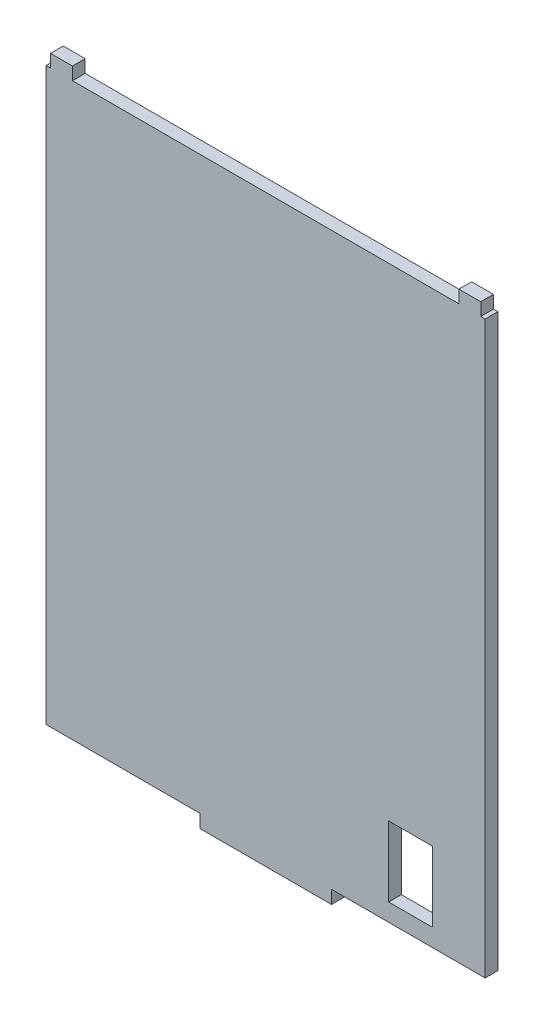
ISO-10303-21;
HEADER;
FILE_DESCRIPTION(('STEP AP214'),'2;1');
FILE_NAME('part.step','',(''),(''),'','','');
FILE_SCHEMA(('AUTOMOTIVE_DESIGN { 1 0 10303 214 1 1 1 1 }'));
ENDSEC;
DATA;
#1=APPLICATION_CONTEXT('core data for automotive mechanical design processes');
#2=APPLICATION_PROTOCOL_DEFINITION('international standard','automotive_design',2000,#1);
#3=PRODUCT_CONTEXT('',#1,'mechanical');
#4=PRODUCT('Part','Part','',(#3));
#5=PRODUCT_RELATED_PRODUCT_CATEGORY('part','',(#4));
#6=PRODUCT_DEFINITION_FORMATION('','',#4);
#7=PRODUCT_DEFINITION_CONTEXT('part definition',#1,'design');
#8=PRODUCT_DEFINITION('design','',#6,#7);
#9=PRODUCT_DEFINITION_SHAPE('','',#8);
#10=(LENGTH_UNIT() NAMED_UNIT(*) SI_UNIT(.MILLI.,.METRE.));
#11=(NAMED_UNIT(*) PLANE_ANGLE_UNIT() SI_UNIT($,.RADIAN.));
#12=(NAMED_UNIT(*) SI_UNIT($,.STERADIAN.) SOLID_ANGLE_UNIT());
#13=UNCERTAINTY_MEASURE_WITH_UNIT(LENGTH_MEASURE(1.E-05),#10,'distance_accuracy_value','');
#14=(GEOMETRIC_REPRESENTATION_CONTEXT(3) GLOBAL_UNCERTAINTY_ASSIGNED_CONTEXT((#13)) GLOBAL_UNIT_ASSIGNED_CONTEXT((#10,
#11,#12)) REPRESENTATION_CONTEXT('',''));
#15=CARTESIAN_POINT('',(0.,0.,0.));
#16=DIRECTION('',(0.,0.,1.));
#17=DIRECTION('',(1.,0.,0.));
#18=AXIS2_PLACEMENT_3D('',#15,#16,#17);
#19=CARTESIAN_POINT('',(35.,0.,2.9));
#20=DIRECTION('',(1.,0.,0.));
#21=DIRECTION('',(0.,0.,-1.));
#22=AXIS2_PLACEMENT_3D('',#19,#20,#21);
#23=PLANE('',#22);
#24=DIRECTION('',(0.,-1.,0.));
#25=VECTOR('',#24,1.);
#26=CARTESIAN_POINT('',(35.,0.,0.));
#27=LINE('',#26,#25);
#28=CARTESIAN_POINT('',(35.,0.,0.));
#29=VERTEX_POINT('',#28);
#30=CARTESIAN_POINT('',(35.,-3.,0.));
#31=VERTEX_POINT('',#30);
#32=EDGE_CURVE('E218',#29,#31,#27,.T.);
#33=ORIENTED_EDGE('',*,*,#32,.T.);
#34=DIRECTION('',(0.,0.,-1.));
#35=VECTOR('',#34,1.);
#36=CARTESIAN_POINT('',(35.,-3.,2.9));
#37=LINE('',#36,#35);
#38=CARTESIAN_POINT('',(35.,-3.,2.9));
#39=VERTEX_POINT('',#38);
#40=EDGE_CURVE('E11',#39,#31,#37,.T.);
#41=ORIENTED_EDGE('',*,*,#40,.F.);
#42=DIRECTION('',(0.,-1.,0.));
#43=VECTOR('',#42,1.);
#44=CARTESIAN_POINT('',(35.,0.,2.9));
#45=LINE('',#44,#43);
#46=CARTESIAN_POINT('',(35.,0.,2.9));
#47=VERTEX_POINT('',#46);
#48=EDGE_CURVE('E390',#47,#39,#45,.T.);
#49=ORIENTED_EDGE('',*,*,#48,.F.);
#50=DIRECTION('',(0.,0.,-1.));
#51=VECTOR('',#50,1.);
#52=CARTESIAN_POINT('',(35.,0.,2.9));
#53=LINE('',#52,#51);
#54=EDGE_CURVE('E257',#47,#29,#53,.T.);
#55=ORIENTED_EDGE('',*,*,#54,.T.);
#56=EDGE_LOOP('',(#33,#41,#49,#55));
#57=FACE_BOUND('',#56,.T.);
#58=ADVANCED_FACE('F35',(#57),#23,.F.);
#59=CARTESIAN_POINT('',(0.,-3.,2.9));
#60=DIRECTION('',(0.,1.,0.));
#61=DIRECTION('',(0.,0.,1.));
#62=AXIS2_PLACEMENT_3D('',#59,#60,#61);
#63=PLANE('',#62);
#64=DIRECTION('',(1.,0.,0.));
#65=VECTOR('',#64,1.);
#66=CARTESIAN_POINT('',(0.,-3.,0.));
#67=LINE('',#66,#65);
#68=CARTESIAN_POINT('',(65.,-3.,0.));
#69=VERTEX_POINT('',#68);
#70=EDGE_CURVE('E221',#31,#69,#67,.T.);
#71=ORIENTED_EDGE('',*,*,#70,.T.);
#72=DIRECTION('',(0.,0.,-1.));
#73=VECTOR('',#72,1.);
#74=CARTESIAN_POINT('',(65.,-3.,2.9));
#75=LINE('',#74,#73);
#76=CARTESIAN_POINT('',(65.,-3.,2.9));
#77=VERTEX_POINT('',#76);
#78=EDGE_CURVE('E45',#77,#69,#75,.T.);
#79=ORIENTED_EDGE('',*,*,#78,.F.);
#80=DIRECTION('',(1.,0.,0.));
#81=VECTOR('',#80,1.);
#82=CARTESIAN_POINT('',(0.,-3.,2.9));
#83=LINE('',#82,#81);
#84=EDGE_CURVE('E392',#39,#77,#83,.T.);
#85=ORIENTED_EDGE('',*,*,#84,.F.);
#86=ORIENTED_EDGE('',*,*,#40,.T.);
#87=EDGE_LOOP('',(#71,#79,#85,#86));
#88=FACE_BOUND('',#87,.T.);
#89=ADVANCED_FACE('F319',(#88),#63,.F.);
#90=CARTESIAN_POINT('',(65.,0.,2.9));
#91=DIRECTION('',(1.,0.,0.));
#92=DIRECTION('',(0.,0.,-1.));
#93=AXIS2_PLACEMENT_3D('',#90,#91,#92);
#94=PLANE('',#93);
#95=DIRECTION('',(0.,-1.,0.));
#96=VECTOR('',#95,1.);
#97=CARTESIAN_POINT('',(65.,0.,0.));
#98=LINE('',#97,#96);
#99=CARTESIAN_POINT('',(65.,0.,0.));
#100=VERTEX_POINT('',#99);
#101=EDGE_CURVE('E224',#100,#69,#98,.T.);
#102=ORIENTED_EDGE('',*,*,#101,.F.);
#103=DIRECTION('',(0.,0.,-1.));
#104=VECTOR('',#103,1.);
#105=CARTESIAN_POINT('',(65.,0.,2.9));
#106=LINE('',#105,#104);
#107=CARTESIAN_POINT('',(65.,0.,2.9));
#108=VERTEX_POINT('',#107);
#109=EDGE_CURVE('E284',#108,#100,#106,.T.);
#110=ORIENTED_EDGE('',*,*,#109,.F.);
#111=DIRECTION('',(0.,-1.,0.));
#112=VECTOR('',#111,1.);
#113=CARTESIAN_POINT('',(65.,0.,2.9));
#114=LINE('',#113,#112);
#115=EDGE_CURVE('E394',#108,#77,#114,.T.);
#116=ORIENTED_EDGE('',*,*,#115,.T.);
#117=ORIENTED_EDGE('',*,*,#78,.T.);
#118=EDGE_LOOP('',(#102,#110,#116,#117));
#119=FACE_BOUND('',#118,.T.);
#120=ADVANCED_FACE('F325',(#119),#94,.T.);
#121=CARTESIAN_POINT('',(0.,0.,2.9));
#122=DIRECTION('',(0.,1.,0.));
#123=DIRECTION('',(0.,0.,1.));
#124=AXIS2_PLACEMENT_3D('',#121,#122,#123);
#125=PLANE('',#124);
#126=DIRECTION('',(1.,0.,0.));
#127=VECTOR('',#126,1.);
#128=CARTESIAN_POINT('',(0.,0.,0.));
#129=LINE('',#128,#127);
#130=CARTESIAN_POINT('',(100.,0.,0.));
#131=VERTEX_POINT('',#130);
#132=EDGE_CURVE('E227',#100,#131,#129,.T.);
#133=ORIENTED_EDGE('',*,*,#132,.T.);
#134=DIRECTION('',(0.,0.,-1.));
#135=VECTOR('',#134,1.);
#136=CARTESIAN_POINT('',(100.,0.,2.9));
#137=LINE('',#136,#135);
#138=CARTESIAN_POINT('',(100.,0.,2.9));
#139=VERTEX_POINT('',#138);
#140=EDGE_CURVE('E281',#139,#131,#137,.T.);
#141=ORIENTED_EDGE('',*,*,#140,.F.);
#142=DIRECTION('',(1.,0.,0.));
#143=VECTOR('',#142,1.);
#144=CARTESIAN_POINT('',(0.,0.,2.9));
#145=LINE('',#144,#143);
#146=EDGE_CURVE('E397',#108,#139,#145,.T.);
#147=ORIENTED_EDGE('',*,*,#146,.F.);
#148=ORIENTED_EDGE('',*,*,#109,.T.);
#149=EDGE_LOOP('',(#133,#141,#147,#148));
#150=FACE_BOUND('',#149,.T.);
#151=ADVANCED_FACE('F331',(#150),#125,.F.);
#152=CARTESIAN_POINT('',(100.,0.,2.9));
#153=DIRECTION('',(-1.,0.,0.));
#154=DIRECTION('',(0.,0.,1.));
#155=AXIS2_PLACEMENT_3D('',#152,#153,#154);
#156=PLANE('',#155);
#157=DIRECTION('',(0.,1.,0.));
#158=VECTOR('',#157,1.);
#159=CARTESIAN_POINT('',(100.,0.,0.));
#160=LINE('',#159,#158);
#161=CARTESIAN_POINT('',(100.,130.,0.));
#162=VERTEX_POINT('',#161);
#163=EDGE_CURVE('E229',#131,#162,#160,.T.);
#164=ORIENTED_EDGE('',*,*,#163,.T.);
#165=DIRECTION('',(0.,0.,-1.));
#166=VECTOR('',#165,1.);
#167=CARTESIAN_POINT('',(100.,130.,2.9));
#168=LINE('',#167,#166);
#169=CARTESIAN_POINT('',(100.,130.,2.9));
#170=VERTEX_POINT('',#169);
#171=EDGE_CURVE('E278',#170,#162,#168,.T.);
#172=ORIENTED_EDGE('',*,*,#171,.F.);
#173=DIRECTION('',(0.,1.,0.));
#174=VECTOR('',#173,1.);
#175=CARTESIAN_POINT('',(100.,0.,2.9));
#176=LINE('',#175,#174);
#177=EDGE_CURVE('E399',#139,#170,#176,.T.);
#178=ORIENTED_EDGE('',*,*,#177,.F.);
#179=ORIENTED_EDGE('',*,*,#140,.T.);
#180=EDGE_LOOP('',(#164,#172,#178,#179));
#181=FACE_BOUND('',#180,.T.);
#182=ADVANCED_FACE('F335',(#181),#156,.F.);
#183=CARTESIAN_POINT('',(0.,130.,2.9));
#184=DIRECTION('',(0.,-1.,0.));
#185=DIRECTION('',(0.,0.,-1.));
#186=AXIS2_PLACEMENT_3D('',#183,#184,#185);
#187=PLANE('',#186);
#188=DIRECTION('',(-1.,0.,0.));
#189=VECTOR('',#188,1.);
#190=CARTESIAN_POINT('',(0.,130.,0.));
#191=LINE('',#190,#189);
#192=CARTESIAN_POINT('',(99.,130.,0.));
#193=VERTEX_POINT('',#192);
#194=EDGE_CURVE('E231',#162,#193,#191,.T.);
#195=ORIENTED_EDGE('',*,*,#194,.T.);
#196=DIRECTION('',(0.,0.,-1.));
#197=VECTOR('',#196,1.);
#198=CARTESIAN_POINT('',(99.,130.,2.9));
#199=LINE('',#198,#197);
#200=CARTESIAN_POINT('',(99.,130.,2.9));
#201=VERTEX_POINT('',#200);
#202=EDGE_CURVE('E275',#201,#193,#199,.T.);
#203=ORIENTED_EDGE('',*,*,#202,.F.);
#204=DIRECTION('',(-1.,0.,0.));
#205=VECTOR('',#204,1.);
#206=CARTESIAN_POINT('',(0.,130.,2.9));
#207=LINE('',#206,#205);
#208=EDGE_CURVE('E401',#170,#201,#207,.T.);
#209=ORIENTED_EDGE('',*,*,#208,.F.);
#210=ORIENTED_EDGE('',*,*,#171,.T.);
#211=EDGE_LOOP('',(#195,#203,#209,#210));
#212=FACE_BOUND('',#211,.T.);
#213=ADVANCED_FACE('F339',(#212),#187,.F.);
#214=CARTESIAN_POINT('',(99.,0.,2.9));
#215=DIRECTION('',(-1.,0.,0.));
#216=DIRECTION('',(0.,0.,1.));
#217=AXIS2_PLACEMENT_3D('',#214,#215,#216);
#218=PLANE('',#217);
#219=DIRECTION('',(0.,1.,0.));
#220=VECTOR('',#219,1.);
#221=CARTESIAN_POINT('',(99.,0.,0.));
#222=LINE('',#221,#220);
#223=CARTESIAN_POINT('',(99.,132.9,0.));
#224=VERTEX_POINT('',#223);
#225=EDGE_CURVE('E233',#193,#224,#222,.T.);
#226=ORIENTED_EDGE('',*,*,#225,.T.);
#227=DIRECTION('',(0.,0.,-1.));
#228=VECTOR('',#227,1.);
#229=CARTESIAN_POINT('',(99.,132.9,2.9));
#230=LINE('',#229,#228);
#231=CARTESIAN_POINT('',(99.,132.9,2.9));
#232=VERTEX_POINT('',#231);
#233=EDGE_CURVE('E272',#232,#224,#230,.T.);
#234=ORIENTED_EDGE('',*,*,#233,.F.);
#235=DIRECTION('',(0.,1.,0.));
#236=VECTOR('',#235,1.);
#237=CARTESIAN_POINT('',(99.,0.,2.9));
#238=LINE('',#237,#236);
#239=EDGE_CURVE('E403',#201,#232,#238,.T.);
#240=ORIENTED_EDGE('',*,*,#239,.F.);
#241=ORIENTED_EDGE('',*,*,#202,.T.);
#242=EDGE_LOOP('',(#226,#234,#240,#241));
#243=FACE_BOUND('',#242,.T.);
#244=ADVANCED_FACE('F343',(#243),#218,.F.);
#245=CARTESIAN_POINT('',(9.22178999829274E-13,132.900000000001,2.9));
#246=DIRECTION('',(0.,-1.,0.));
#247=DIRECTION('',(1.,0.,0.));
#248=AXIS2_PLACEMENT_3D('',#245,#246,#247);
#249=PLANE('',#248);
#250=DIRECTION('',(-1.,0.,0.));
#251=VECTOR('',#250,1.);
#252=CARTESIAN_POINT('',(9.22178999829274E-13,132.900000000001,0.));
#253=LINE('',#252,#251);
#254=CARTESIAN_POINT('',(94.,132.9,0.));
#255=VERTEX_POINT('',#254);
#256=EDGE_CURVE('E235',#224,#255,#253,.T.);
#257=ORIENTED_EDGE('',*,*,#256,.T.);
#258=DIRECTION('',(0.,0.,-1.));
#259=VECTOR('',#258,1.);
#260=CARTESIAN_POINT('',(94.,132.9,2.9));
#261=LINE('',#260,#259);
#262=CARTESIAN_POINT('',(94.,132.9,2.9));
#263=VERTEX_POINT('',#262);
#264=EDGE_CURVE('E269',#263,#255,#261,.T.);
#265=ORIENTED_EDGE('',*,*,#264,.F.);
#266=DIRECTION('',(-1.,0.,0.));
#267=VECTOR('',#266,1.);
#268=CARTESIAN_POINT('',(9.22178999829274E-13,132.900000000001,2.9));
#269=LINE('',#268,#267);
#270=EDGE_CURVE('E405',#232,#263,#269,.T.);
#271=ORIENTED_EDGE('',*,*,#270,.F.);
#272=ORIENTED_EDGE('',*,*,#233,.T.);
#273=EDGE_LOOP('',(#257,#265,#271,#272));
#274=FACE_BOUND('',#273,.T.);
#275=ADVANCED_FACE('F347',(#274),#249,.F.);
#276=CARTESIAN_POINT('',(94.,0.,2.9));
#277=DIRECTION('',(1.,0.,0.));
#278=DIRECTION('',(0.,0.,-1.));
#279=AXIS2_PLACEMENT_3D('',#276,#277,#278);
#280=PLANE('',#279);
#281=DIRECTION('',(0.,-1.,0.));
#282=VECTOR('',#281,1.);
#283=CARTESIAN_POINT('',(94.,0.,0.));
#284=LINE('',#283,#282);
#285=CARTESIAN_POINT('',(94.,130.,0.));
#286=VERTEX_POINT('',#285);
#287=EDGE_CURVE('E237',#255,#286,#284,.T.);
#288=ORIENTED_EDGE('',*,*,#287,.T.);
#289=DIRECTION('',(0.,0.,-1.));
#290=VECTOR('',#289,1.);
#291=CARTESIAN_POINT('',(94.,130.,2.9));
#292=LINE('',#291,#290);
#293=CARTESIAN_POINT('',(94.,130.,2.9));
#294=VERTEX_POINT('',#293);
#295=EDGE_CURVE('E267',#294,#286,#292,.T.);
#296=ORIENTED_EDGE('',*,*,#295,.F.);
#297=DIRECTION('',(0.,-1.,0.));
#298=VECTOR('',#297,1.);
#299=CARTESIAN_POINT('',(94.,0.,2.9));
#300=LINE('',#299,#298);
#301=EDGE_CURVE('E407',#263,#294,#300,.T.);
#302=ORIENTED_EDGE('',*,*,#301,.F.);
#303=ORIENTED_EDGE('',*,*,#264,.T.);
#304=EDGE_LOOP('',(#288,#296,#302,#303));
#305=FACE_BOUND('',#304,.T.);
#306=ADVANCED_FACE('F351',(#305),#280,.F.);
#307=CARTESIAN_POINT('',(0.,130.,2.9));
#308=DIRECTION('',(0.,1.,0.));
#309=DIRECTION('',(0.,0.,1.));
#310=AXIS2_PLACEMENT_3D('',#307,#308,#309);
#311=PLANE('',#310);
#312=DIRECTION('',(1.,0.,0.));
#313=VECTOR('',#312,1.);
#314=CARTESIAN_POINT('',(0.,130.,0.));
#315=LINE('',#314,#313);
#316=CARTESIAN_POINT('',(6.,130.,0.));
#317=VERTEX_POINT('',#316);
#318=EDGE_CURVE('E240',#317,#286,#315,.T.);
#319=ORIENTED_EDGE('',*,*,#318,.F.);
#320=DIRECTION('',(0.,0.,-1.));
#321=VECTOR('',#320,1.);
#322=CARTESIAN_POINT('',(6.,130.,2.9));
#323=LINE('',#322,#321);
#324=CARTESIAN_POINT('',(6.,130.,2.9));
#325=VERTEX_POINT('',#324);
#326=EDGE_CURVE('E265',#325,#317,#323,.T.);
#327=ORIENTED_EDGE('',*,*,#326,.F.);
#328=DIRECTION('',(1.,0.,0.));
#329=VECTOR('',#328,1.);
#330=CARTESIAN_POINT('',(0.,130.,2.9));
#331=LINE('',#330,#329);
#332=EDGE_CURVE('E409',#325,#294,#331,.T.);
#333=ORIENTED_EDGE('',*,*,#332,.T.);
#334=ORIENTED_EDGE('',*,*,#295,.T.);
#335=EDGE_LOOP('',(#319,#327,#333,#334));
#336=FACE_BOUND('',#335,.T.);
#337=ADVANCED_FACE('F355',(#336),#311,.T.);
#338=CARTESIAN_POINT('',(6.,0.,2.9));
#339=DIRECTION('',(1.,0.,0.));
#340=DIRECTION('',(0.,0.,-1.));
#341=AXIS2_PLACEMENT_3D('',#338,#339,#340);
#342=PLANE('',#341);
#343=DIRECTION('',(0.,-1.,0.));
#344=VECTOR('',#343,1.);
#345=CARTESIAN_POINT('',(6.,0.,0.));
#346=LINE('',#345,#344);
#347=CARTESIAN_POINT('',(6.,132.9,0.));
#348=VERTEX_POINT('',#347);
#349=EDGE_CURVE('E243',#348,#317,#346,.T.);
#350=ORIENTED_EDGE('',*,*,#349,.F.);
#351=DIRECTION('',(0.,0.,-1.));
#352=VECTOR('',#351,1.);
#353=CARTESIAN_POINT('',(6.,132.9,2.9));
#354=LINE('',#353,#352);
#355=CARTESIAN_POINT('',(6.,132.9,2.9));
#356=VERTEX_POINT('',#355);
#357=EDGE_CURVE('E263',#356,#348,#354,.T.);
#358=ORIENTED_EDGE('',*,*,#357,.F.);
#359=DIRECTION('',(0.,-1.,0.));
#360=VECTOR('',#359,1.);
#361=CARTESIAN_POINT('',(6.,0.,2.9));
#362=LINE('',#361,#360);
#363=EDGE_CURVE('E412',#356,#325,#362,.T.);
#364=ORIENTED_EDGE('',*,*,#363,.T.);
#365=ORIENTED_EDGE('',*,*,#326,.T.);
#366=EDGE_LOOP('',(#350,#358,#364,#365));
#367=FACE_BOUND('',#366,.T.);
#368=ADVANCED_FACE('F359',(#367),#342,.T.);
#369=CARTESIAN_POINT('',(0.,132.9,2.9));
#370=DIRECTION('',(0.,1.,0.));
#371=DIRECTION('',(0.,0.,1.));
#372=AXIS2_PLACEMENT_3D('',#369,#370,#371);
#373=PLANE('',#372);
#374=DIRECTION('',(1.,0.,0.));
#375=VECTOR('',#374,1.);
#376=CARTESIAN_POINT('',(0.,132.9,0.));
#377=LINE('',#376,#375);
#378=CARTESIAN_POINT('',(1.,132.9,0.));
#379=VERTEX_POINT('',#378);
#380=EDGE_CURVE('E246',#379,#348,#377,.T.);
#381=ORIENTED_EDGE('',*,*,#380,.F.);
#382=DIRECTION('',(0.,0.,-1.));
#383=VECTOR('',#382,1.);
#384=CARTESIAN_POINT('',(1.,132.9,2.9));
#385=LINE('',#384,#383);
#386=CARTESIAN_POINT('',(1.,132.9,2.9));
#387=VERTEX_POINT('',#386);
#388=EDGE_CURVE('E261',#387,#379,#385,.T.);
#389=ORIENTED_EDGE('',*,*,#388,.F.);
#390=DIRECTION('',(1.,0.,0.));
#391=VECTOR('',#390,1.);
#392=CARTESIAN_POINT('',(0.,132.9,2.9));
#393=LINE('',#392,#391);
#394=EDGE_CURVE('E415',#387,#356,#393,.T.);
#395=ORIENTED_EDGE('',*,*,#394,.T.);
#396=ORIENTED_EDGE('',*,*,#357,.T.);
#397=EDGE_LOOP('',(#381,#389,#395,#396));
#398=FACE_BOUND('',#397,.T.);
#399=ADVANCED_FACE('F363',(#398),#373,.T.);
#400=CARTESIAN_POINT('',(1.,0.,2.9));
#401=DIRECTION('',(-1.,0.,0.));
#402=DIRECTION('',(0.,0.,1.));
#403=AXIS2_PLACEMENT_3D('',#400,#401,#402);
#404=PLANE('',#403);
#405=DIRECTION('',(0.,1.,0.));
#406=VECTOR('',#405,1.);
#407=CARTESIAN_POINT('',(1.,0.,0.));
#408=LINE('',#407,#406);
#409=CARTESIAN_POINT('',(1.,130.,0.));
#410=VERTEX_POINT('',#409);
#411=EDGE_CURVE('E249',#410,#379,#408,.T.);
#412=ORIENTED_EDGE('',*,*,#411,.F.);
#413=DIRECTION('',(0.,0.,-1.));
#414=VECTOR('',#413,1.);
#415=CARTESIAN_POINT('',(1.,130.,2.9));
#416=LINE('',#415,#414);
#417=CARTESIAN_POINT('',(1.,130.,2.9));
#418=VERTEX_POINT('',#417);
#419=EDGE_CURVE('E191',#418,#410,#416,.T.);
#420=ORIENTED_EDGE('',*,*,#419,.F.);
#421=DIRECTION('',(0.,1.,0.));
#422=VECTOR('',#421,1.);
#423=CARTESIAN_POINT('',(1.,0.,2.9));
#424=LINE('',#423,#422);
#425=EDGE_CURVE('E198',#418,#387,#424,.T.);
#426=ORIENTED_EDGE('',*,*,#425,.T.);
#427=ORIENTED_EDGE('',*,*,#388,.T.);
#428=EDGE_LOOP('',(#412,#420,#426,#427));
#429=FACE_BOUND('',#428,.T.);
#430=ADVANCED_FACE('F367',(#429),#404,.T.);
#431=CARTESIAN_POINT('',(0.,130.,2.9));
#432=DIRECTION('',(0.,1.,0.));
#433=DIRECTION('',(0.,0.,1.));
#434=AXIS2_PLACEMENT_3D('',#431,#432,#433);
#435=PLANE('',#434);
#436=DIRECTION('',(1.,0.,0.));
#437=VECTOR('',#436,1.);
#438=CARTESIAN_POINT('',(0.,130.,0.));
#439=LINE('',#438,#437);
#440=CARTESIAN_POINT('',(0.,130.,0.));
#441=VERTEX_POINT('',#440);
#442=EDGE_CURVE('E186',#441,#410,#439,.T.);
#443=ORIENTED_EDGE('',*,*,#442,.F.);
#444=DIRECTION('',(0.,0.,-1.));
#445=VECTOR('',#444,1.);
#446=CARTESIAN_POINT('',(0.,130.,2.9));
#447=LINE('',#446,#445);
#448=CARTESIAN_POINT('',(0.,130.,2.9));
#449=VERTEX_POINT('',#448);
#450=EDGE_CURVE('E181',#449,#441,#447,.T.);
#451=ORIENTED_EDGE('',*,*,#450,.F.);
#452=DIRECTION('',(1.,0.,0.));
#453=VECTOR('',#452,1.);
#454=CARTESIAN_POINT('',(0.,130.,2.9));
#455=LINE('',#454,#453);
#456=EDGE_CURVE('E184',#449,#418,#455,.T.);
#457=ORIENTED_EDGE('',*,*,#456,.T.);
#458=ORIENTED_EDGE('',*,*,#419,.T.);
#459=EDGE_LOOP('',(#443,#451,#457,#458));
#460=FACE_BOUND('',#459,.T.);
#461=ADVANCED_FACE('F183',(#460),#435,.T.);
#462=CARTESIAN_POINT('',(0.,0.,2.9));
#463=DIRECTION('',(-1.,0.,0.));
#464=DIRECTION('',(0.,0.,1.));
#465=AXIS2_PLACEMENT_3D('',#462,#463,#464);
#466=PLANE('',#465);
#467=DIRECTION('',(0.,1.,0.));
#468=VECTOR('',#467,1.);
#469=CARTESIAN_POINT('',(0.,0.,0.));
#470=LINE('',#469,#468);
#471=CARTESIAN_POINT('',(0.,0.,0.));
#472=VERTEX_POINT('',#471);
#473=EDGE_CURVE('E253',#472,#441,#470,.T.);
#474=ORIENTED_EDGE('',*,*,#473,.F.);
#475=DIRECTION('',(0.,0.,-1.));
#476=VECTOR('',#475,1.);
#477=CARTESIAN_POINT('',(0.,0.,2.9));
#478=LINE('',#477,#476);
#479=CARTESIAN_POINT('',(0.,0.,2.9));
#480=VERTEX_POINT('',#479);
#481=EDGE_CURVE('E118',#480,#472,#478,.T.);
#482=ORIENTED_EDGE('',*,*,#481,.F.);
#483=DIRECTION('',(0.,1.,0.));
#484=VECTOR('',#483,1.);
#485=CARTESIAN_POINT('',(0.,0.,2.9));
#486=LINE('',#485,#484);
#487=EDGE_CURVE('E195',#480,#449,#486,.T.);
#488=ORIENTED_EDGE('',*,*,#487,.T.);
#489=ORIENTED_EDGE('',*,*,#450,.T.);
#490=EDGE_LOOP('',(#474,#482,#488,#489));
#491=FACE_BOUND('',#490,.T.);
#492=ADVANCED_FACE('F200',(#491),#466,.T.);
#493=CARTESIAN_POINT('',(0.,4.,2.9));
#494=DIRECTION('',(0.,1.,0.));
#495=DIRECTION('',(0.,0.,1.));
#496=AXIS2_PLACEMENT_3D('',#493,#494,#495);
#497=PLANE('',#496);
#498=DIRECTION('',(1.,0.,0.));
#499=VECTOR('',#498,1.);
#500=CARTESIAN_POINT('',(0.,4.,0.));
#501=LINE('',#500,#499);
#502=CARTESIAN_POINT('',(78.,4.,0.));
#503=VERTEX_POINT('',#502);
#504=CARTESIAN_POINT('',(88.,4.,0.));
#505=VERTEX_POINT('',#504);
#506=EDGE_CURVE('E206',#503,#505,#501,.T.);
#507=ORIENTED_EDGE('',*,*,#506,.F.);
#508=DIRECTION('',(0.,0.,-1.));
#509=VECTOR('',#508,1.);
#510=CARTESIAN_POINT('',(78.,4.,2.9));
#511=LINE('',#510,#509);
#512=CARTESIAN_POINT('',(78.,4.,2.9));
#513=VERTEX_POINT('',#512);
#514=EDGE_CURVE('E39',#513,#503,#511,.T.);
#515=ORIENTED_EDGE('',*,*,#514,.F.);
#516=DIRECTION('',(1.,0.,0.));
#517=VECTOR('',#516,1.);
#518=CARTESIAN_POINT('',(0.,4.,2.9));
#519=LINE('',#518,#517);
#520=CARTESIAN_POINT('',(88.,4.,2.9));
#521=VERTEX_POINT('',#520);
#522=EDGE_CURVE('E256',#513,#521,#519,.T.);
#523=ORIENTED_EDGE('',*,*,#522,.T.);
#524=DIRECTION('',(0.,0.,-1.));
#525=VECTOR('',#524,1.);
#526=CARTESIAN_POINT('',(88.,4.,2.9));
#527=LINE('',#526,#525);
#528=EDGE_CURVE('E202',#521,#505,#527,.T.);
#529=ORIENTED_EDGE('',*,*,#528,.T.);
#530=EDGE_LOOP('',(#507,#515,#523,#529));
#531=FACE_BOUND('',#530,.T.);
#532=ADVANCED_FACE('F37',(#531),#497,.T.);
#533=CARTESIAN_POINT('',(78.,0.,2.9));
#534=DIRECTION('',(-1.,0.,0.));
#535=DIRECTION('',(0.,0.,1.));
#536=AXIS2_PLACEMENT_3D('',#533,#534,#535);
#537=PLANE('',#536);
#538=DIRECTION('',(0.,1.,0.));
#539=VECTOR('',#538,1.);
#540=CARTESIAN_POINT('',(78.,0.,0.));
#541=LINE('',#540,#539);
#542=CARTESIAN_POINT('',(78.,20.,0.));
#543=VERTEX_POINT('',#542);
#544=EDGE_CURVE('E209',#503,#543,#541,.T.);
#545=ORIENTED_EDGE('',*,*,#544,.T.);
#546=DIRECTION('',(0.,0.,-1.));
#547=VECTOR('',#546,1.);
#548=CARTESIAN_POINT('',(78.,20.,2.9));
#549=LINE('',#548,#547);
#550=CARTESIAN_POINT('',(78.,20.,2.9));
#551=VERTEX_POINT('',#550);
#552=EDGE_CURVE('E289',#551,#543,#549,.T.);
#553=ORIENTED_EDGE('',*,*,#552,.F.);
#554=DIRECTION('',(0.,1.,0.));
#555=VECTOR('',#554,1.);
#556=CARTESIAN_POINT('',(78.,0.,2.9));
#557=LINE('',#556,#555);
#558=EDGE_CURVE('E297',#513,#551,#557,.T.);
#559=ORIENTED_EDGE('',*,*,#558,.F.);
#560=ORIENTED_EDGE('',*,*,#514,.T.);
#561=EDGE_LOOP('',(#545,#553,#559,#560));
#562=FACE_BOUND('',#561,.T.);
#563=ADVANCED_FACE('F296',(#562),#537,.F.);
#564=CARTESIAN_POINT('',(0.,20.,2.9));
#565=DIRECTION('',(0.,-1.,0.));
#566=DIRECTION('',(0.,0.,-1.));
#567=AXIS2_PLACEMENT_3D('',#564,#565,#566);
#568=PLANE('',#567);
#569=DIRECTION('',(-1.,0.,0.));
#570=VECTOR('',#569,1.);
#571=CARTESIAN_POINT('',(0.,20.,0.));
#572=LINE('',#571,#570);
#573=CARTESIAN_POINT('',(88.,20.,0.));
#574=VERTEX_POINT('',#573);
#575=EDGE_CURVE('E212',#574,#543,#572,.T.);
#576=ORIENTED_EDGE('',*,*,#575,.F.);
#577=DIRECTION('',(0.,0.,-1.));
#578=VECTOR('',#577,1.);
#579=CARTESIAN_POINT('',(88.,20.,2.9));
#580=LINE('',#579,#578);
#581=CARTESIAN_POINT('',(88.,20.,2.9));
#582=VERTEX_POINT('',#581);
#583=EDGE_CURVE('E288',#582,#574,#580,.T.);
#584=ORIENTED_EDGE('',*,*,#583,.F.);
#585=DIRECTION('',(-1.,0.,0.));
#586=VECTOR('',#585,1.);
#587=CARTESIAN_POINT('',(0.,20.,2.9));
#588=LINE('',#587,#586);
#589=EDGE_CURVE('E385',#582,#551,#588,.T.);
#590=ORIENTED_EDGE('',*,*,#589,.T.);
#591=ORIENTED_EDGE('',*,*,#552,.T.);
#592=EDGE_LOOP('',(#576,#584,#590,#591));
#593=FACE_BOUND('',#592,.T.);
#594=ADVANCED_FACE('F309',(#593),#568,.T.);
#595=CARTESIAN_POINT('',(88.,0.,2.9));
#596=DIRECTION('',(-1.,0.,0.));
#597=DIRECTION('',(0.,0.,1.));
#598=AXIS2_PLACEMENT_3D('',#595,#596,#597);
#599=PLANE('',#598);
#600=DIRECTION('',(0.,1.,0.));
#601=VECTOR('',#600,1.);
#602=CARTESIAN_POINT('',(88.,0.,0.));
#603=LINE('',#602,#601);
#604=EDGE_CURVE('E215',#505,#574,#603,.T.);
#605=ORIENTED_EDGE('',*,*,#604,.F.);
#606=ORIENTED_EDGE('',*,*,#528,.F.);
#607=DIRECTION('',(0.,1.,0.));
#608=VECTOR('',#607,1.);
#609=CARTESIAN_POINT('',(88.,0.,2.9));
#610=LINE('',#609,#608);
#611=EDGE_CURVE('E307',#521,#582,#610,.T.);
#612=ORIENTED_EDGE('',*,*,#611,.T.);
#613=ORIENTED_EDGE('',*,*,#583,.T.);
#614=EDGE_LOOP('',(#605,#606,#612,#613));
#615=FACE_BOUND('',#614,.T.);
#616=ADVANCED_FACE('F306',(#615),#599,.T.);
#617=CARTESIAN_POINT('',(0.,0.,2.9));
#618=DIRECTION('',(0.,1.,0.));
#619=DIRECTION('',(0.,0.,1.));
#620=AXIS2_PLACEMENT_3D('',#617,#618,#619);
#621=PLANE('',#620);
#622=DIRECTION('',(1.,0.,0.));
#623=VECTOR('',#622,1.);
#624=CARTESIAN_POINT('',(0.,0.,0.));
#625=LINE('',#624,#623);
#626=EDGE_CURVE('E121',#472,#29,#625,.T.);
#627=ORIENTED_EDGE('',*,*,#626,.T.);
#628=ORIENTED_EDGE('',*,*,#54,.F.);
#629=DIRECTION('',(1.,0.,0.));
#630=VECTOR('',#629,1.);
#631=CARTESIAN_POINT('',(0.,0.,2.9));
#632=LINE('',#631,#630);
#633=EDGE_CURVE('E54',#480,#47,#632,.T.);
#634=ORIENTED_EDGE('',*,*,#633,.F.);
#635=ORIENTED_EDGE('',*,*,#481,.T.);
#636=EDGE_LOOP('',(#627,#628,#634,#635));
#637=FACE_BOUND('',#636,.T.);
#638=ADVANCED_FACE('F316',(#637),#621,.F.);
#639=CARTESIAN_POINT('',(0.,0.,2.9));
#640=DIRECTION('',(0.,0.,1.));
#641=DIRECTION('',(1.,0.,0.));
#642=AXIS2_PLACEMENT_3D('',#639,#640,#641);
#643=PLANE('',#642);
#644=ORIENTED_EDGE('',*,*,#522,.F.);
#645=ORIENTED_EDGE('',*,*,#558,.T.);
#646=ORIENTED_EDGE('',*,*,#589,.F.);
#647=ORIENTED_EDGE('',*,*,#611,.F.);
#648=EDGE_LOOP('',(#644,#645,#646,#647));
#649=FACE_BOUND('',#648,.T.);
#650=ORIENTED_EDGE('',*,*,#48,.T.);
#651=ORIENTED_EDGE('',*,*,#84,.T.);
#652=ORIENTED_EDGE('',*,*,#115,.F.);
#653=ORIENTED_EDGE('',*,*,#146,.T.);
#654=ORIENTED_EDGE('',*,*,#177,.T.);
#655=ORIENTED_EDGE('',*,*,#208,.T.);
#656=ORIENTED_EDGE('',*,*,#239,.T.);
#657=ORIENTED_EDGE('',*,*,#270,.T.);
#658=ORIENTED_EDGE('',*,*,#301,.T.);
#659=ORIENTED_EDGE('',*,*,#332,.F.);
#660=ORIENTED_EDGE('',*,*,#363,.F.);
#661=ORIENTED_EDGE('',*,*,#394,.F.);
#662=ORIENTED_EDGE('',*,*,#425,.F.);
#663=ORIENTED_EDGE('',*,*,#456,.F.);
#664=ORIENTED_EDGE('',*,*,#487,.F.);
#665=ORIENTED_EDGE('',*,*,#633,.T.);
#666=EDGE_LOOP('',(#650,#651,#652,#653,#654,#655,#656,#657,#658,#659,#660,#661,#662,#663,#664,#665));
#667=FACE_BOUND('',#666,.T.);
#668=ADVANCED_FACE('F194',(#649,#667),#643,.T.);
#669=CARTESIAN_POINT('',(0.,0.,0.));
#670=DIRECTION('',(0.,0.,1.));
#671=DIRECTION('',(1.,0.,0.));
#672=AXIS2_PLACEMENT_3D('',#669,#670,#671);
#673=PLANE('',#672);
#674=ORIENTED_EDGE('',*,*,#506,.T.);
#675=ORIENTED_EDGE('',*,*,#604,.T.);
#676=ORIENTED_EDGE('',*,*,#575,.T.);
#677=ORIENTED_EDGE('',*,*,#544,.F.);
#678=EDGE_LOOP('',(#674,#675,#676,#677));
#679=FACE_BOUND('',#678,.T.);
#680=ORIENTED_EDGE('',*,*,#32,.F.);
#681=ORIENTED_EDGE('',*,*,#626,.F.);
#682=ORIENTED_EDGE('',*,*,#473,.T.);
#683=ORIENTED_EDGE('',*,*,#442,.T.);
#684=ORIENTED_EDGE('',*,*,#411,.T.);
#685=ORIENTED_EDGE('',*,*,#380,.T.);
#686=ORIENTED_EDGE('',*,*,#349,.T.);
#687=ORIENTED_EDGE('',*,*,#318,.T.);
#688=ORIENTED_EDGE('',*,*,#287,.F.);
#689=ORIENTED_EDGE('',*,*,#256,.F.);
#690=ORIENTED_EDGE('',*,*,#225,.F.);
#691=ORIENTED_EDGE('',*,*,#194,.F.);
#692=ORIENTED_EDGE('',*,*,#163,.F.);
#693=ORIENTED_EDGE('',*,*,#132,.F.);
#694=ORIENTED_EDGE('',*,*,#101,.T.);
#695=ORIENTED_EDGE('',*,*,#70,.F.);
#696=EDGE_LOOP('',(#680,#681,#682,#683,#684,#685,#686,#687,#688,#689,#690,#691,#692,#693,#694,#695));
#697=FACE_BOUND('',#696,.T.);
#698=ADVANCED_FACE('F300',(#679,#697),#673,.F.);
#699=CLOSED_SHELL('',(#58,#89,#120,#151,#182,#213,#244,#275,#306,#337,#368,#399,#430,#461,#492,
#532,#563,#594,#616,#638,#668,#698));
#700=MANIFOLD_SOLID_BREP('B2',#699);
#701=ADVANCED_BREP_SHAPE_REPRESENTATION('',(#18,#700),#14);
#702=SHAPE_DEFINITION_REPRESENTATION(#9,#701);
ENDSEC;
END-ISO-10303-21;
